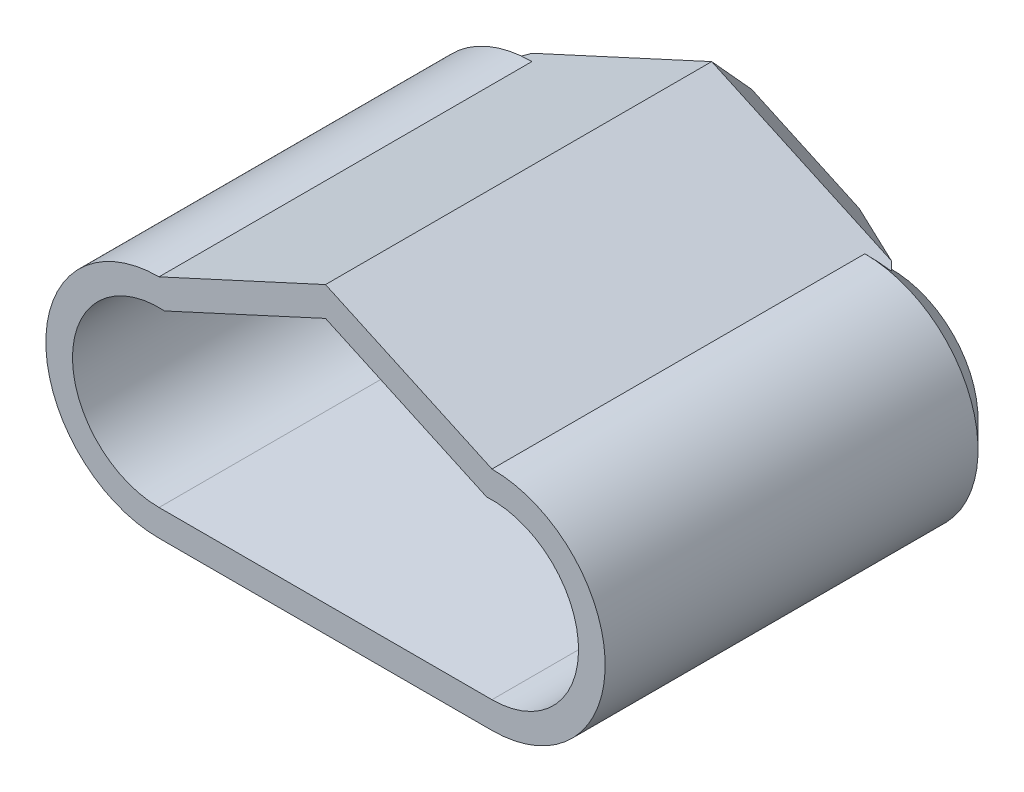
ISO-10303-21;
HEADER;
FILE_DESCRIPTION(('STEP AP214'),'2;1');
FILE_NAME('part.step','',(''),(''),'','','');
FILE_SCHEMA(('AUTOMOTIVE_DESIGN { 1 0 10303 214 1 1 1 1 }'));
ENDSEC;
DATA;
#1=APPLICATION_CONTEXT('core data for automotive mechanical design processes');
#2=APPLICATION_PROTOCOL_DEFINITION('international standard','automotive_design',2000,#1);
#3=PRODUCT_CONTEXT('',#1,'mechanical');
#4=PRODUCT('Part','Part','',(#3));
#5=PRODUCT_RELATED_PRODUCT_CATEGORY('part','',(#4));
#6=PRODUCT_DEFINITION_FORMATION('','',#4);
#7=PRODUCT_DEFINITION_CONTEXT('part definition',#1,'design');
#8=PRODUCT_DEFINITION('design','',#6,#7);
#9=PRODUCT_DEFINITION_SHAPE('','',#8);
#10=(LENGTH_UNIT() NAMED_UNIT(*) SI_UNIT(.MILLI.,.METRE.));
#11=(NAMED_UNIT(*) PLANE_ANGLE_UNIT() SI_UNIT($,.RADIAN.));
#12=(NAMED_UNIT(*) SI_UNIT($,.STERADIAN.) SOLID_ANGLE_UNIT());
#13=UNCERTAINTY_MEASURE_WITH_UNIT(LENGTH_MEASURE(1.E-05),#10,'distance_accuracy_value','');
#14=(GEOMETRIC_REPRESENTATION_CONTEXT(3) GLOBAL_UNCERTAINTY_ASSIGNED_CONTEXT((#13)) GLOBAL_UNIT_ASSIGNED_CONTEXT((#10,
#11,#12)) REPRESENTATION_CONTEXT('',''));
#15=CARTESIAN_POINT('',(0.,0.,0.));
#16=DIRECTION('',(0.,0.,1.));
#17=DIRECTION('',(1.,0.,0.));
#18=AXIS2_PLACEMENT_3D('',#15,#16,#17);
#19=CARTESIAN_POINT('',(-12.5,0.,0.));
#20=DIRECTION('',(0.,0.,1.));
#21=DIRECTION('',(1.,0.,0.));
#22=AXIS2_PLACEMENT_3D('',#19,#20,#21);
#23=PLANE('',#22);
#24=CARTESIAN_POINT('',(-12.5,0.,0.));
#25=DIRECTION('',(0.,0.,1.));
#26=DIRECTION('',(1.,0.,0.));
#27=AXIS2_PLACEMENT_3D('',#24,#25,#26);
#28=CIRCLE('',#27,3.5);
#29=CARTESIAN_POINT('',(-9.,0.,0.));
#30=VERTEX_POINT('',#29);
#31=EDGE_CURVE('E467',#30,#30,#28,.T.);
#32=ORIENTED_EDGE('',*,*,#31,.T.);
#33=EDGE_LOOP('',(#32));
#34=FACE_BOUND('',#33,.T.);
#35=DIRECTION('',(0.,1.,0.));
#36=VECTOR('',#35,1.);
#37=CARTESIAN_POINT('',(-3.,-8.5,0.));
#38=LINE('',#37,#36);
#39=CARTESIAN_POINT('',(-3.,-6.49999999999998,0.));
#40=VERTEX_POINT('',#39);
#41=CARTESIAN_POINT('',(-3.,0.,0.));
#42=VERTEX_POINT('',#41);
#43=EDGE_CURVE('E221',#40,#42,#38,.T.);
#44=ORIENTED_EDGE('',*,*,#43,.F.);
#45=DIRECTION('',(-1.,0.,0.));
#46=VECTOR('',#45,1.);
#47=CARTESIAN_POINT('',(-12.5,-6.49999999999998,0.));
#48=LINE('',#47,#46);
#49=CARTESIAN_POINT('',(-12.5,-6.49999999999998,0.));
#50=VERTEX_POINT('',#49);
#51=EDGE_CURVE('E248',#40,#50,#48,.T.);
#52=ORIENTED_EDGE('',*,*,#51,.T.);
#53=CARTESIAN_POINT('',(-12.5,0.,0.));
#54=DIRECTION('',(0.,0.,1.));
#55=DIRECTION('',(1.,0.,0.));
#56=AXIS2_PLACEMENT_3D('',#53,#54,#55);
#57=CIRCLE('',#56,6.49999999999998);
#58=CARTESIAN_POINT('',(-9.36212708239051,5.69242949477045,0.));
#59=VERTEX_POINT('',#58);
#60=EDGE_CURVE('E246',#50,#59,#57,.F.);
#61=ORIENTED_EDGE('',*,*,#60,.T.);
#62=DIRECTION('',(-0.745241313525099,0.666794859469826,0.));
#63=VECTOR('',#62,1.);
#64=CARTESIAN_POINT('',(-3.,0.,0.));
#65=LINE('',#64,#63);
#66=EDGE_CURVE('E406',#42,#59,#65,.T.);
#67=ORIENTED_EDGE('',*,*,#66,.F.);
#68=EDGE_LOOP('',(#44,#52,#61,#67));
#69=FACE_BOUND('',#68,.T.);
#70=ADVANCED_FACE('F63',(#34,#69),#23,.F.);
#71=CARTESIAN_POINT('',(12.5,0.,0.));
#72=DIRECTION('',(0.,0.,1.));
#73=DIRECTION('',(1.,0.,0.));
#74=AXIS2_PLACEMENT_3D('',#71,#72,#73);
#75=CIRCLE('',#74,3.5);
#76=CARTESIAN_POINT('',(16.,0.,0.));
#77=VERTEX_POINT('',#76);
#78=EDGE_CURVE('E463',#77,#77,#75,.T.);
#79=ORIENTED_EDGE('',*,*,#78,.T.);
#80=EDGE_LOOP('',(#79));
#81=FACE_BOUND('',#80,.T.);
#82=CARTESIAN_POINT('',(12.5,0.,0.));
#83=DIRECTION('',(0.,0.,1.));
#84=DIRECTION('',(1.,0.,0.));
#85=AXIS2_PLACEMENT_3D('',#82,#83,#84);
#86=CIRCLE('',#85,6.49999999999998);
#87=CARTESIAN_POINT('',(9.36212708239051,5.69242949477045,0.));
#88=VERTEX_POINT('',#87);
#89=CARTESIAN_POINT('',(12.5,-6.49999999999998,0.));
#90=VERTEX_POINT('',#89);
#91=EDGE_CURVE('E241',#88,#90,#86,.F.);
#92=ORIENTED_EDGE('',*,*,#91,.T.);
#93=DIRECTION('',(-1.,0.,0.));
#94=VECTOR('',#93,1.);
#95=CARTESIAN_POINT('',(-12.5,-6.49999999999998,0.));
#96=LINE('',#95,#94);
#97=CARTESIAN_POINT('',(3.,-6.49999999999998,0.));
#98=VERTEX_POINT('',#97);
#99=EDGE_CURVE('E217',#90,#98,#96,.T.);
#100=ORIENTED_EDGE('',*,*,#99,.T.);
#101=DIRECTION('',(0.,-1.,0.));
#102=VECTOR('',#101,1.);
#103=CARTESIAN_POINT('',(3.,0.,0.));
#104=LINE('',#103,#102);
#105=CARTESIAN_POINT('',(3.,0.,0.));
#106=VERTEX_POINT('',#105);
#107=EDGE_CURVE('E211',#106,#98,#104,.T.);
#108=ORIENTED_EDGE('',*,*,#107,.F.);
#109=DIRECTION('',(-0.745241313525099,-0.666794859469826,0.));
#110=VECTOR('',#109,1.);
#111=CARTESIAN_POINT('',(12.5,8.5,0.));
#112=LINE('',#111,#110);
#113=EDGE_CURVE('E201',#88,#106,#112,.T.);
#114=ORIENTED_EDGE('',*,*,#113,.F.);
#115=EDGE_LOOP('',(#92,#100,#108,#114));
#116=FACE_BOUND('',#115,.T.);
#117=ADVANCED_FACE('F215',(#81,#116),#23,.F.);
#118=CARTESIAN_POINT('',(-12.5,0.,5.));
#119=DIRECTION('',(0.,0.,1.));
#120=DIRECTION('',(1.,0.,0.));
#121=AXIS2_PLACEMENT_3D('',#118,#119,#120);
#122=PLANE('',#121);
#123=CARTESIAN_POINT('',(-12.5,0.,5.));
#124=DIRECTION('',(0.,0.,1.));
#125=DIRECTION('',(1.,0.,0.));
#126=AXIS2_PLACEMENT_3D('',#123,#124,#125);
#127=CIRCLE('',#126,6.5);
#128=CARTESIAN_POINT('',(-12.0903864255455,6.48708075482514,5.));
#129=VERTEX_POINT('',#128);
#130=CARTESIAN_POINT('',(-12.5,-6.5,5.));
#131=VERTEX_POINT('',#130);
#132=EDGE_CURVE('E409',#129,#131,#127,.T.);
#133=ORIENTED_EDGE('',*,*,#132,.T.);
#134=DIRECTION('',(1.,0.,0.));
#135=VECTOR('',#134,1.);
#136=CARTESIAN_POINT('',(-12.5,-6.5,5.));
#137=LINE('',#136,#135);
#138=CARTESIAN_POINT('',(12.5,-6.5,5.));
#139=VERTEX_POINT('',#138);
#140=EDGE_CURVE('E427',#131,#139,#137,.T.);
#141=ORIENTED_EDGE('',*,*,#140,.T.);
#142=CARTESIAN_POINT('',(12.5,0.,5.));
#143=DIRECTION('',(0.,0.,1.));
#144=DIRECTION('',(1.,0.,0.));
#145=AXIS2_PLACEMENT_3D('',#142,#143,#144);
#146=CIRCLE('',#145,6.5);
#147=CARTESIAN_POINT('',(12.0903864255455,6.48708075482513,5.));
#148=VERTEX_POINT('',#147);
#149=EDGE_CURVE('E429',#139,#148,#146,.T.);
#150=ORIENTED_EDGE('',*,*,#149,.T.);
#151=DIRECTION('',(-0.908581589602671,0.41770742755556,0.));
#152=VECTOR('',#151,1.);
#153=CARTESIAN_POINT('',(11.6645851448889,6.68283682079466,5.));
#154=LINE('',#153,#152);
#155=CARTESIAN_POINT('',(0.,12.0454634798986,5.));
#156=VERTEX_POINT('',#155);
#157=EDGE_CURVE('E431',#148,#156,#154,.T.);
#158=ORIENTED_EDGE('',*,*,#157,.T.);
#159=DIRECTION('',(-0.908581589602671,-0.41770742755556,0.));
#160=VECTOR('',#159,1.);
#161=CARTESIAN_POINT('',(0.835414855111121,12.4295335447816,5.));
#162=LINE('',#161,#160);
#163=EDGE_CURVE('E416',#156,#129,#162,.T.);
#164=ORIENTED_EDGE('',*,*,#163,.T.);
#165=EDGE_LOOP('',(#133,#141,#150,#158,#164));
#166=FACE_BOUND('',#165,.T.);
#167=CARTESIAN_POINT('',(-12.5,0.,5.));
#168=DIRECTION('',(0.,0.,1.));
#169=DIRECTION('',(1.,0.,0.));
#170=AXIS2_PLACEMENT_3D('',#167,#168,#169);
#171=CIRCLE('',#170,3.5);
#172=CARTESIAN_POINT('',(-9.,0.,5.));
#173=VERTEX_POINT('',#172);
#174=EDGE_CURVE('E470',#173,#173,#171,.T.);
#175=ORIENTED_EDGE('',*,*,#174,.F.);
#176=EDGE_LOOP('',(#175));
#177=FACE_BOUND('',#176,.T.);
#178=CARTESIAN_POINT('',(12.5,0.,5.));
#179=DIRECTION('',(0.,0.,1.));
#180=DIRECTION('',(1.,0.,0.));
#181=AXIS2_PLACEMENT_3D('',#178,#179,#180);
#182=CIRCLE('',#181,3.5);
#183=CARTESIAN_POINT('',(16.,0.,5.));
#184=VERTEX_POINT('',#183);
#185=EDGE_CURVE('E464',#184,#184,#182,.T.);
#186=ORIENTED_EDGE('',*,*,#185,.F.);
#187=EDGE_LOOP('',(#186));
#188=FACE_BOUND('',#187,.T.);
#189=ADVANCED_FACE('F311',(#166,#177,#188),#122,.T.);
#190=CARTESIAN_POINT('',(-12.5,0.,5.));
#191=DIRECTION('',(0.,0.,-1.));
#192=DIRECTION('',(-1.,0.,0.));
#193=AXIS2_PLACEMENT_3D('',#190,#191,#192);
#194=CYLINDRICAL_SURFACE('',#193,8.5);
#195=DIRECTION('',(0.,0.,-1.));
#196=VECTOR('',#195,1.);
#197=CARTESIAN_POINT('',(-12.5,8.5,5.));
#198=LINE('',#197,#196);
#199=CARTESIAN_POINT('',(-12.5,8.5,30.));
#200=VERTEX_POINT('',#199);
#201=CARTESIAN_POINT('',(-12.5,8.5,2.00000000000001));
#202=VERTEX_POINT('',#201);
#203=EDGE_CURVE('E473',#200,#202,#198,.T.);
#204=ORIENTED_EDGE('',*,*,#203,.T.);
#205=CARTESIAN_POINT('',(-12.5,0.,2.00000000000001));
#206=DIRECTION('',(0.,0.,1.));
#207=DIRECTION('',(1.,0.,0.));
#208=AXIS2_PLACEMENT_3D('',#205,#206,#207);
#209=CIRCLE('',#208,8.5);
#210=CARTESIAN_POINT('',(-12.5,-8.5,2.00000000000001));
#211=VERTEX_POINT('',#210);
#212=EDGE_CURVE('E250',#202,#211,#209,.T.);
#213=ORIENTED_EDGE('',*,*,#212,.T.);
#214=DIRECTION('',(0.,0.,-1.));
#215=VECTOR('',#214,1.);
#216=CARTESIAN_POINT('',(-12.5,-8.5,5.));
#217=LINE('',#216,#215);
#218=CARTESIAN_POINT('',(-12.5,-8.5,30.));
#219=VERTEX_POINT('',#218);
#220=EDGE_CURVE('E485',#219,#211,#217,.T.);
#221=ORIENTED_EDGE('',*,*,#220,.F.);
#222=CARTESIAN_POINT('',(-12.5,0.,30.));
#223=DIRECTION('',(0.,0.,1.));
#224=DIRECTION('',(1.,0.,0.));
#225=AXIS2_PLACEMENT_3D('',#222,#223,#224);
#226=CIRCLE('',#225,8.5);
#227=EDGE_CURVE('E448',#200,#219,#226,.T.);
#228=ORIENTED_EDGE('',*,*,#227,.F.);
#229=EDGE_LOOP('',(#204,#213,#221,#228));
#230=FACE_BOUND('',#229,.T.);
#231=ADVANCED_FACE('F314',(#230),#194,.T.);
#232=CARTESIAN_POINT('',(-12.5,-8.5,5.));
#233=DIRECTION('',(0.,1.,0.));
#234=DIRECTION('',(0.,0.,1.));
#235=AXIS2_PLACEMENT_3D('',#232,#233,#234);
#236=PLANE('',#235);
#237=DIRECTION('',(-0.707106781186546,0.,-0.707106781186549));
#238=VECTOR('',#237,1.);
#239=CARTESIAN_POINT('',(0.999999999999991,-8.5,-2.));
#240=LINE('',#239,#238);
#241=CARTESIAN_POINT('',(0.999999999999991,-8.5,-2.));
#242=VERTEX_POINT('',#241);
#243=CARTESIAN_POINT('',(4.99999999999999,-8.5,2.00000000000002));
#244=VERTEX_POINT('',#243);
#245=EDGE_CURVE('E387',#242,#244,#240,.F.);
#246=ORIENTED_EDGE('',*,*,#245,.T.);
#247=DIRECTION('',(1.,0.,0.));
#248=VECTOR('',#247,1.);
#249=CARTESIAN_POINT('',(-12.5,-8.5,2.00000000000001));
#250=LINE('',#249,#248);
#251=CARTESIAN_POINT('',(12.5,-8.5,2.00000000000001));
#252=VERTEX_POINT('',#251);
#253=EDGE_CURVE('E237',#244,#252,#250,.T.);
#254=ORIENTED_EDGE('',*,*,#253,.T.);
#255=DIRECTION('',(0.,0.,-1.));
#256=VECTOR('',#255,1.);
#257=CARTESIAN_POINT('',(12.5,-8.5,5.));
#258=LINE('',#257,#256);
#259=CARTESIAN_POINT('',(12.5,-8.5,30.));
#260=VERTEX_POINT('',#259);
#261=EDGE_CURVE('E482',#260,#252,#258,.T.);
#262=ORIENTED_EDGE('',*,*,#261,.F.);
#263=DIRECTION('',(1.,0.,0.));
#264=VECTOR('',#263,1.);
#265=CARTESIAN_POINT('',(-12.5,-8.5,30.));
#266=LINE('',#265,#264);
#267=EDGE_CURVE('E451',#219,#260,#266,.T.);
#268=ORIENTED_EDGE('',*,*,#267,.F.);
#269=ORIENTED_EDGE('',*,*,#220,.T.);
#270=DIRECTION('',(1.,0.,0.));
#271=VECTOR('',#270,1.);
#272=CARTESIAN_POINT('',(-12.5,-8.5,2.00000000000001));
#273=LINE('',#272,#271);
#274=CARTESIAN_POINT('',(-4.99999999999999,-8.5,2.00000000000001));
#275=VERTEX_POINT('',#274);
#276=EDGE_CURVE('E234',#211,#275,#273,.T.);
#277=ORIENTED_EDGE('',*,*,#276,.T.);
#278=DIRECTION('',(-0.707106781186546,0.,0.707106781186549));
#279=VECTOR('',#278,1.);
#280=CARTESIAN_POINT('',(-0.999999999999991,-8.5,-2.));
#281=LINE('',#280,#279);
#282=CARTESIAN_POINT('',(-0.999999999999991,-8.5,-2.));
#283=VERTEX_POINT('',#282);
#284=EDGE_CURVE('E389',#275,#283,#281,.F.);
#285=ORIENTED_EDGE('',*,*,#284,.T.);
#286=DIRECTION('',(-1.,0.,0.));
#287=VECTOR('',#286,1.);
#288=CARTESIAN_POINT('',(3.,-8.5,-2.));
#289=LINE('',#288,#287);
#290=EDGE_CURVE('E407',#242,#283,#289,.T.);
#291=ORIENTED_EDGE('',*,*,#290,.F.);
#292=EDGE_LOOP('',(#246,#254,#262,#268,#269,#277,#285,#291));
#293=FACE_BOUND('',#292,.T.);
#294=ADVANCED_FACE('F492',(#293),#236,.F.);
#295=CARTESIAN_POINT('',(12.5,0.,5.));
#296=DIRECTION('',(0.,0.,-1.));
#297=DIRECTION('',(-1.,0.,0.));
#298=AXIS2_PLACEMENT_3D('',#295,#296,#297);
#299=CYLINDRICAL_SURFACE('',#298,8.5);
#300=ORIENTED_EDGE('',*,*,#261,.T.);
#301=CARTESIAN_POINT('',(12.5,0.,2.00000000000001));
#302=DIRECTION('',(0.,0.,1.));
#303=DIRECTION('',(1.,0.,0.));
#304=AXIS2_PLACEMENT_3D('',#301,#302,#303);
#305=CIRCLE('',#304,8.5);
#306=CARTESIAN_POINT('',(12.5,8.5,2.00000000000001));
#307=VERTEX_POINT('',#306);
#308=EDGE_CURVE('E244',#252,#307,#305,.T.);
#309=ORIENTED_EDGE('',*,*,#308,.T.);
#310=DIRECTION('',(0.,0.,-1.));
#311=VECTOR('',#310,1.);
#312=CARTESIAN_POINT('',(12.5,8.5,5.));
#313=LINE('',#312,#311);
#314=CARTESIAN_POINT('',(12.5,8.5,30.));
#315=VERTEX_POINT('',#314);
#316=EDGE_CURVE('E480',#315,#307,#313,.T.);
#317=ORIENTED_EDGE('',*,*,#316,.F.);
#318=CARTESIAN_POINT('',(12.5,0.,30.));
#319=DIRECTION('',(0.,0.,1.));
#320=DIRECTION('',(1.,0.,0.));
#321=AXIS2_PLACEMENT_3D('',#318,#319,#320);
#322=CIRCLE('',#321,8.5);
#323=EDGE_CURVE('E454',#260,#315,#322,.T.);
#324=ORIENTED_EDGE('',*,*,#323,.F.);
#325=EDGE_LOOP('',(#300,#309,#317,#324));
#326=FACE_BOUND('',#325,.T.);
#327=ADVANCED_FACE('F506',(#326),#299,.T.);
#328=CARTESIAN_POINT('',(0.,14.2466967239869,5.));
#329=DIRECTION('',(-0.41770742755556,-0.908581589602671,0.));
#330=DIRECTION('',(0.908581589602671,-0.41770742755556,0.));
#331=AXIS2_PLACEMENT_3D('',#328,#329,#330);
#332=PLANE('',#331);
#333=DIRECTION('',(0.669609996445444,-0.307843645833754,0.675910306460935));
#334=VECTOR('',#333,1.);
#335=CARTESIAN_POINT('',(7.74241117324123,10.6872336099849,-4.80235262164523));
#336=LINE('',#335,#334);
#337=CARTESIAN_POINT('',(13.9521974832325,7.83237291844204,1.46586109995968));
#338=VERTEX_POINT('',#337);
#339=CARTESIAN_POINT('',(13.4906787780046,8.0445495609534,1.00000000000001));
#340=VERTEX_POINT('',#339);
#341=EDGE_CURVE('E238',#338,#340,#336,.F.);
#342=ORIENTED_EDGE('',*,*,#341,.T.);
#343=DIRECTION('',(-0.908581589602671,0.41770742755556,0.));
#344=VECTOR('',#343,1.);
#345=CARTESIAN_POINT('',(0.,14.2466967239869,1.00000000000002));
#346=LINE('',#345,#344);
#347=CARTESIAN_POINT('',(0.,14.2466967239869,1.00000000000002));
#348=VERTEX_POINT('',#347);
#349=EDGE_CURVE('E12',#340,#348,#346,.T.);
#350=ORIENTED_EDGE('',*,*,#349,.T.);
#351=DIRECTION('',(0.,0.,-1.));
#352=VECTOR('',#351,1.);
#353=CARTESIAN_POINT('',(0.,14.2466967239869,5.));
#354=LINE('',#353,#352);
#355=CARTESIAN_POINT('',(0.,14.2466967239869,30.));
#356=VERTEX_POINT('',#355);
#357=EDGE_CURVE('E478',#356,#348,#354,.T.);
#358=ORIENTED_EDGE('',*,*,#357,.F.);
#359=DIRECTION('',(-0.908581589602671,0.41770742755556,0.));
#360=VECTOR('',#359,1.);
#361=CARTESIAN_POINT('',(12.5,8.5,30.));
#362=LINE('',#361,#360);
#363=EDGE_CURVE('E457',#315,#356,#362,.T.);
#364=ORIENTED_EDGE('',*,*,#363,.F.);
#365=ORIENTED_EDGE('',*,*,#316,.T.);
#366=CARTESIAN_POINT('',(12.5,8.5,2.00000000000001));
#367=CARTESIAN_POINT('',(12.6179262819994,8.44578507372498,1.94578814518541));
#368=CARTESIAN_POINT('',(12.7366577623017,8.39119996901399,1.89365420830995));
#369=CARTESIAN_POINT('',(12.9755424277295,8.28137615107601,1.79412645904957));
#370=CARTESIAN_POINT('',(13.0956932016034,8.22613854638755,1.74672562402031));
#371=CARTESIAN_POINT('',(13.3376029899084,8.11492397135133,1.65707461204479));
#372=CARTESIAN_POINT('',(13.4593622652077,8.05894688107314,1.61482528222833));
#373=CARTESIAN_POINT('',(13.7045735102787,7.94621450837438,1.53595826072242));
#374=CARTESIAN_POINT('',(13.8280277569112,7.88945817919958,1.49934916268672));
#375=CARTESIAN_POINT('',(13.9521974832326,7.83237291844203,1.46586109995972));
#376=B_SPLINE_CURVE_WITH_KNOTS('',3,(#366,#367,#368,#369,#370,#371,#372,#373,#374,#375),
.UNSPECIFIED.,.F.,.F.,(4,2,2,2,4),(0.,0.421981641871252,0.843327571440572,1.26474269528835,
1.68679368382566),.UNSPECIFIED.);
#377=EDGE_CURVE('E254',#307,#338,#376,.T.);
#378=ORIENTED_EDGE('',*,*,#377,.T.);
#379=EDGE_LOOP('',(#342,#350,#358,#364,#365,#378));
#380=FACE_BOUND('',#379,.T.);
#381=ADVANCED_FACE('F267',(#380),#332,.F.);
#382=CARTESIAN_POINT('',(-12.5,8.5,5.));
#383=DIRECTION('',(0.41770742755556,-0.908581589602671,0.));
#384=DIRECTION('',(0.908581589602671,0.41770742755556,0.));
#385=AXIS2_PLACEMENT_3D('',#382,#383,#384);
#386=PLANE('',#385);
#387=ORIENTED_EDGE('',*,*,#357,.T.);
#388=DIRECTION('',(-0.908581589602671,-0.41770742755556,0.));
#389=VECTOR('',#388,1.);
#390=CARTESIAN_POINT('',(-12.5,8.5,1.00000000000002));
#391=LINE('',#390,#389);
#392=CARTESIAN_POINT('',(-13.4906787780046,8.0445495609534,1.00000000000001));
#393=VERTEX_POINT('',#392);
#394=EDGE_CURVE('E376',#348,#393,#391,.T.);
#395=ORIENTED_EDGE('',*,*,#394,.T.);
#396=DIRECTION('',(0.669609996445444,0.307843645833754,-0.675910306460935));
#397=VECTOR('',#396,1.);
#398=CARTESIAN_POINT('',(-7.74241117324123,10.6872336099849,-4.80235262164523));
#399=LINE('',#398,#397);
#400=CARTESIAN_POINT('',(-13.9521974832325,7.83237291844204,1.46586109995968));
#401=VERTEX_POINT('',#400);
#402=EDGE_CURVE('E368',#393,#401,#399,.F.);
#403=ORIENTED_EDGE('',*,*,#402,.T.);
#404=CARTESIAN_POINT('',(-13.9521974832325,7.83237291844204,1.46586109995968));
#405=CARTESIAN_POINT('',(-13.8280277569112,7.88945817919958,1.49934916268671));
#406=CARTESIAN_POINT('',(-13.7045735102787,7.94621450837438,1.53595826072242));
#407=CARTESIAN_POINT('',(-13.4593622652077,8.05894688107314,1.61482528222834));
#408=CARTESIAN_POINT('',(-13.3376029899084,8.11492397135133,1.65707461204479));
#409=CARTESIAN_POINT('',(-13.0956932016034,8.22613854638755,1.74672562402031));
#410=CARTESIAN_POINT('',(-12.9755424277295,8.28137615107601,1.79412645904957));
#411=CARTESIAN_POINT('',(-12.7366577623017,8.39119996901399,1.89365420830995));
#412=CARTESIAN_POINT('',(-12.6179262819994,8.44578507372498,1.94578814518541));
#413=CARTESIAN_POINT('',(-12.5,8.5,2.00000000000001));
#414=B_SPLINE_CURVE_WITH_KNOTS('',3,(#404,#405,#406,#407,#408,#409,#410,#411,#412,#413),
.UNSPECIFIED.,.F.,.F.,(4,2,2,2,4),(0.,0.422050988537303,0.843466112385086,1.26481204195441,
1.68679368382566),.UNSPECIFIED.);
#415=EDGE_CURVE('E296',#401,#202,#414,.T.);
#416=ORIENTED_EDGE('',*,*,#415,.T.);
#417=ORIENTED_EDGE('',*,*,#203,.F.);
#418=DIRECTION('',(-0.908581589602671,-0.41770742755556,0.));
#419=VECTOR('',#418,1.);
#420=CARTESIAN_POINT('',(0.,14.2466967239869,30.));
#421=LINE('',#420,#419);
#422=EDGE_CURVE('E460',#356,#200,#421,.T.);
#423=ORIENTED_EDGE('',*,*,#422,.F.);
#424=EDGE_LOOP('',(#387,#395,#403,#416,#417,#423));
#425=FACE_BOUND('',#424,.T.);
#426=ADVANCED_FACE('F302',(#425),#386,.F.);
#427=CARTESIAN_POINT('',(-12.5,0.,5.));
#428=DIRECTION('',(0.,0.,-1.));
#429=DIRECTION('',(-1.,0.,0.));
#430=AXIS2_PLACEMENT_3D('',#427,#428,#429);
#431=CYLINDRICAL_SURFACE('',#430,3.5);
#432=ORIENTED_EDGE('',*,*,#174,.T.);
#433=EDGE_LOOP('',(#432));
#434=FACE_BOUND('',#433,.T.);
#435=ORIENTED_EDGE('',*,*,#31,.F.);
#436=EDGE_LOOP('',(#435));
#437=FACE_BOUND('',#436,.T.);
#438=ADVANCED_FACE('F306',(#434,#437),#431,.F.);
#439=CARTESIAN_POINT('',(12.5,0.,5.));
#440=DIRECTION('',(0.,0.,-1.));
#441=DIRECTION('',(-1.,0.,0.));
#442=AXIS2_PLACEMENT_3D('',#439,#440,#441);
#443=CYLINDRICAL_SURFACE('',#442,3.5);
#444=ORIENTED_EDGE('',*,*,#185,.T.);
#445=EDGE_LOOP('',(#444));
#446=FACE_BOUND('',#445,.T.);
#447=ORIENTED_EDGE('',*,*,#78,.F.);
#448=EDGE_LOOP('',(#447));
#449=FACE_BOUND('',#448,.T.);
#450=ADVANCED_FACE('F318',(#446,#449),#443,.F.);
#451=CARTESIAN_POINT('',(-12.5,0.,30.));
#452=DIRECTION('',(0.,0.,1.));
#453=DIRECTION('',(1.,0.,0.));
#454=AXIS2_PLACEMENT_3D('',#451,#452,#453);
#455=PLANE('',#454);
#456=ORIENTED_EDGE('',*,*,#227,.T.);
#457=ORIENTED_EDGE('',*,*,#267,.T.);
#458=ORIENTED_EDGE('',*,*,#323,.T.);
#459=ORIENTED_EDGE('',*,*,#363,.T.);
#460=ORIENTED_EDGE('',*,*,#422,.T.);
#461=EDGE_LOOP('',(#456,#457,#458,#459,#460));
#462=FACE_BOUND('',#461,.T.);
#463=DIRECTION('',(1.,0.,0.));
#464=VECTOR('',#463,1.);
#465=CARTESIAN_POINT('',(-12.5,-6.5,30.));
#466=LINE('',#465,#464);
#467=CARTESIAN_POINT('',(-12.5,-6.5,30.));
#468=VERTEX_POINT('',#467);
#469=CARTESIAN_POINT('',(12.5,-6.5,30.));
#470=VERTEX_POINT('',#469);
#471=EDGE_CURVE('E415',#468,#470,#466,.T.);
#472=ORIENTED_EDGE('',*,*,#471,.F.);
#473=CARTESIAN_POINT('',(-12.5,0.,30.));
#474=DIRECTION('',(0.,0.,1.));
#475=DIRECTION('',(1.,0.,0.));
#476=AXIS2_PLACEMENT_3D('',#473,#474,#475);
#477=CIRCLE('',#476,6.5);
#478=CARTESIAN_POINT('',(-12.0903864255455,6.48708075482514,30.));
#479=VERTEX_POINT('',#478);
#480=EDGE_CURVE('E413',#479,#468,#477,.T.);
#481=ORIENTED_EDGE('',*,*,#480,.F.);
#482=DIRECTION('',(-0.908581589602671,-0.41770742755556,0.));
#483=VECTOR('',#482,1.);
#484=CARTESIAN_POINT('',(0.835414855111121,12.4295335447816,30.));
#485=LINE('',#484,#483);
#486=CARTESIAN_POINT('',(0.,12.0454634798986,30.));
#487=VERTEX_POINT('',#486);
#488=EDGE_CURVE('E423',#487,#479,#485,.T.);
#489=ORIENTED_EDGE('',*,*,#488,.F.);
#490=DIRECTION('',(-0.908581589602671,0.41770742755556,0.));
#491=VECTOR('',#490,1.);
#492=CARTESIAN_POINT('',(11.6645851448889,6.68283682079466,30.));
#493=LINE('',#492,#491);
#494=CARTESIAN_POINT('',(12.0903864255455,6.48708075482514,30.));
#495=VERTEX_POINT('',#494);
#496=EDGE_CURVE('E420',#495,#487,#493,.T.);
#497=ORIENTED_EDGE('',*,*,#496,.F.);
#498=CARTESIAN_POINT('',(12.5,0.,30.));
#499=DIRECTION('',(0.,0.,1.));
#500=DIRECTION('',(1.,0.,0.));
#501=AXIS2_PLACEMENT_3D('',#498,#499,#500);
#502=CIRCLE('',#501,6.5);
#503=EDGE_CURVE('E418',#470,#495,#502,.T.);
#504=ORIENTED_EDGE('',*,*,#503,.F.);
#505=EDGE_LOOP('',(#472,#481,#489,#497,#504));
#506=FACE_BOUND('',#505,.T.);
#507=ADVANCED_FACE('F322',(#462,#506),#455,.T.);
#508=CARTESIAN_POINT('',(-12.5,0.,30.));
#509=DIRECTION('',(0.,0.,-1.));
#510=DIRECTION('',(-1.,0.,0.));
#511=AXIS2_PLACEMENT_3D('',#508,#509,#510);
#512=CYLINDRICAL_SURFACE('',#511,6.5);
#513=ORIENTED_EDGE('',*,*,#132,.F.);
#514=DIRECTION('',(0.,0.,-1.));
#515=VECTOR('',#514,1.);
#516=CARTESIAN_POINT('',(-12.0903864255455,6.48708075482514,30.));
#517=LINE('',#516,#515);
#518=EDGE_CURVE('E425',#479,#129,#517,.T.);
#519=ORIENTED_EDGE('',*,*,#518,.F.);
#520=ORIENTED_EDGE('',*,*,#480,.T.);
#521=DIRECTION('',(0.,0.,-1.));
#522=VECTOR('',#521,1.);
#523=CARTESIAN_POINT('',(-12.5,-6.5,30.));
#524=LINE('',#523,#522);
#525=EDGE_CURVE('E445',#468,#131,#524,.T.);
#526=ORIENTED_EDGE('',*,*,#525,.T.);
#527=EDGE_LOOP('',(#513,#519,#520,#526));
#528=FACE_BOUND('',#527,.T.);
#529=ADVANCED_FACE('F326',(#528),#512,.F.);
#530=CARTESIAN_POINT('',(-12.5,-6.5,30.));
#531=DIRECTION('',(0.,1.,0.));
#532=DIRECTION('',(0.,0.,1.));
#533=AXIS2_PLACEMENT_3D('',#530,#531,#532);
#534=PLANE('',#533);
#535=ORIENTED_EDGE('',*,*,#140,.F.);
#536=ORIENTED_EDGE('',*,*,#525,.F.);
#537=ORIENTED_EDGE('',*,*,#471,.T.);
#538=DIRECTION('',(0.,0.,-1.));
#539=VECTOR('',#538,1.);
#540=CARTESIAN_POINT('',(12.5,-6.5,30.));
#541=LINE('',#540,#539);
#542=EDGE_CURVE('E442',#470,#139,#541,.T.);
#543=ORIENTED_EDGE('',*,*,#542,.T.);
#544=EDGE_LOOP('',(#535,#536,#537,#543));
#545=FACE_BOUND('',#544,.T.);
#546=ADVANCED_FACE('F330',(#545),#534,.T.);
#547=CARTESIAN_POINT('',(12.5,0.,30.));
#548=DIRECTION('',(0.,0.,-1.));
#549=DIRECTION('',(-1.,0.,0.));
#550=AXIS2_PLACEMENT_3D('',#547,#548,#549);
#551=CYLINDRICAL_SURFACE('',#550,6.5);
#552=ORIENTED_EDGE('',*,*,#149,.F.);
#553=ORIENTED_EDGE('',*,*,#542,.F.);
#554=ORIENTED_EDGE('',*,*,#503,.T.);
#555=DIRECTION('',(0.,0.,-1.));
#556=VECTOR('',#555,1.);
#557=CARTESIAN_POINT('',(12.0903864255455,6.48708075482514,30.));
#558=LINE('',#557,#556);
#559=EDGE_CURVE('E439',#495,#148,#558,.T.);
#560=ORIENTED_EDGE('',*,*,#559,.T.);
#561=EDGE_LOOP('',(#552,#553,#554,#560));
#562=FACE_BOUND('',#561,.T.);
#563=ADVANCED_FACE('F334',(#562),#551,.F.);
#564=CARTESIAN_POINT('',(11.6645851448889,6.68283682079466,30.));
#565=DIRECTION('',(-0.41770742755556,-0.908581589602671,0.));
#566=DIRECTION('',(0.908581589602671,-0.41770742755556,0.));
#567=AXIS2_PLACEMENT_3D('',#564,#565,#566);
#568=PLANE('',#567);
#569=ORIENTED_EDGE('',*,*,#157,.F.);
#570=ORIENTED_EDGE('',*,*,#559,.F.);
#571=ORIENTED_EDGE('',*,*,#496,.T.);
#572=DIRECTION('',(0.,0.,-1.));
#573=VECTOR('',#572,1.);
#574=CARTESIAN_POINT('',(0.,12.0454634798986,30.));
#575=LINE('',#574,#573);
#576=EDGE_CURVE('E436',#487,#156,#575,.T.);
#577=ORIENTED_EDGE('',*,*,#576,.T.);
#578=EDGE_LOOP('',(#569,#570,#571,#577));
#579=FACE_BOUND('',#578,.T.);
#580=ADVANCED_FACE('F338',(#579),#568,.T.);
#581=CARTESIAN_POINT('',(0.835414855111121,12.4295335447816,30.));
#582=DIRECTION('',(0.41770742755556,-0.908581589602671,0.));
#583=DIRECTION('',(0.908581589602671,0.41770742755556,0.));
#584=AXIS2_PLACEMENT_3D('',#581,#582,#583);
#585=PLANE('',#584);
#586=ORIENTED_EDGE('',*,*,#163,.F.);
#587=ORIENTED_EDGE('',*,*,#576,.F.);
#588=ORIENTED_EDGE('',*,*,#488,.T.);
#589=ORIENTED_EDGE('',*,*,#518,.T.);
#590=EDGE_LOOP('',(#586,#587,#588,#589));
#591=FACE_BOUND('',#590,.T.);
#592=ADVANCED_FACE('F342',(#591),#585,.T.);
#593=CARTESIAN_POINT('',(0.,0.,-2.));
#594=DIRECTION('',(0.,0.,1.));
#595=DIRECTION('',(1.,0.,0.));
#596=AXIS2_PLACEMENT_3D('',#593,#594,#595);
#597=PLANE('',#596);
#598=DIRECTION('',(-0.745241313525099,0.666794859469826,0.));
#599=VECTOR('',#598,1.);
#600=CARTESIAN_POINT('',(-0.000256434906497411,-0.000286603719026519,-2.));
#601=LINE('',#600,#599);
#602=CARTESIAN_POINT('',(-0.999999999999991,0.894220796627782,-2.));
#603=VERTEX_POINT('',#602);
#604=CARTESIAN_POINT('',(-8.08090400998462,7.22976648977193,-2.));
#605=VERTEX_POINT('',#604);
#606=EDGE_CURVE('E360',#603,#605,#601,.T.);
#607=ORIENTED_EDGE('',*,*,#606,.T.);
#608=DIRECTION('',(0.908581589602671,0.41770742755556,0.));
#609=VECTOR('',#608,1.);
#610=CARTESIAN_POINT('',(-4.15380227266868,9.03519550485968,-2.));
#611=LINE('',#610,#609);
#612=CARTESIAN_POINT('',(0.,10.9448468578544,-2.));
#613=VERTEX_POINT('',#612);
#614=EDGE_CURVE('E362',#605,#613,#611,.T.);
#615=ORIENTED_EDGE('',*,*,#614,.T.);
#616=DIRECTION('',(0.908581589602671,-0.41770742755556,0.));
#617=VECTOR('',#616,1.);
#618=CARTESIAN_POINT('',(4.15380227266868,9.03519550485968,-2.));
#619=LINE('',#618,#617);
#620=CARTESIAN_POINT('',(8.08090400998462,7.22976648977193,-2.));
#621=VERTEX_POINT('',#620);
#622=EDGE_CURVE('E300',#613,#621,#619,.T.);
#623=ORIENTED_EDGE('',*,*,#622,.T.);
#624=DIRECTION('',(-0.745241313525099,-0.666794859469826,0.));
#625=VECTOR('',#624,1.);
#626=CARTESIAN_POINT('',(0.000256434906495532,-0.000286603719024418,-2.));
#627=LINE('',#626,#625);
#628=CARTESIAN_POINT('',(0.999999999999992,0.894220796627788,-2.));
#629=VERTEX_POINT('',#628);
#630=EDGE_CURVE('E488',#621,#629,#627,.T.);
#631=ORIENTED_EDGE('',*,*,#630,.T.);
#632=DIRECTION('',(0.,-1.,0.));
#633=VECTOR('',#632,1.);
#634=CARTESIAN_POINT('',(0.999999999999992,0.,-2.));
#635=LINE('',#634,#633);
#636=EDGE_CURVE('E225',#629,#242,#635,.T.);
#637=ORIENTED_EDGE('',*,*,#636,.T.);
#638=ORIENTED_EDGE('',*,*,#290,.T.);
#639=DIRECTION('',(0.,1.,0.));
#640=VECTOR('',#639,1.);
#641=CARTESIAN_POINT('',(-0.999999999999991,0.,-2.));
#642=LINE('',#641,#640);
#643=EDGE_CURVE('E365',#283,#603,#642,.T.);
#644=ORIENTED_EDGE('',*,*,#643,.T.);
#645=EDGE_LOOP('',(#607,#615,#623,#631,#637,#638,#644));
#646=FACE_BOUND('',#645,.T.);
#647=ADVANCED_FACE('F346',(#646),#597,.F.);
#648=CARTESIAN_POINT('',(-0.999999999999991,0.,-2.));
#649=DIRECTION('',(0.707106781186549,0.,0.707106781186546));
#650=DIRECTION('',(0.,1.,0.));
#651=AXIS2_PLACEMENT_3D('',#648,#649,#650);
#652=PLANE('',#651);
#653=ORIENTED_EDGE('',*,*,#284,.F.);
#654=DIRECTION('',(0.577350269189624,0.577350269189628,-0.577350269189626));
#655=VECTOR('',#654,1.);
#656=CARTESIAN_POINT('',(-7.49999999999997,-11.,4.50000000000001));
#657=LINE('',#656,#655);
#658=EDGE_CURVE('E493',#275,#40,#657,.T.);
#659=ORIENTED_EDGE('',*,*,#658,.T.);
#660=ORIENTED_EDGE('',*,*,#43,.T.);
#661=DIRECTION('',(0.674214004513799,0.301448092106968,-0.674214004513801));
#662=VECTOR('',#661,1.);
#663=CARTESIAN_POINT('',(-0.727352196288921,1.01612446474445,-2.27264780371107));
#664=LINE('',#663,#662);
#665=EDGE_CURVE('E212',#603,#42,#664,.F.);
#666=ORIENTED_EDGE('',*,*,#665,.F.);
#667=ORIENTED_EDGE('',*,*,#643,.F.);
#668=EDGE_LOOP('',(#653,#659,#660,#666,#667));
#669=FACE_BOUND('',#668,.T.);
#670=ADVANCED_FACE('F349',(#669),#652,.F.);
#671=CARTESIAN_POINT('',(-0.000256434906496833,-0.000286603719025872,-2.));
#672=DIRECTION('',(0.471495166791446,0.526965186413969,0.707106781186546));
#673=DIRECTION('',(-0.745241313525099,0.666794859469826,0.));
#674=AXIS2_PLACEMENT_3D('',#671,#672,#673);
#675=PLANE('',#674);
#676=ORIENTED_EDGE('',*,*,#402,.F.);
#677=DIRECTION('',(0.867040888379541,-0.130587735750107,-0.480819031600952));
#678=VECTOR('',#677,1.);
#679=CARTESIAN_POINT('',(-1.18757509496665,6.19154069574353,-5.82270753069134));
#680=LINE('',#679,#678);
#681=EDGE_CURVE('E373',#393,#605,#680,.T.);
#682=ORIENTED_EDGE('',*,*,#681,.T.);
#683=ORIENTED_EDGE('',*,*,#606,.F.);
#684=ORIENTED_EDGE('',*,*,#665,.T.);
#685=ORIENTED_EDGE('',*,*,#66,.T.);
#686=CARTESIAN_POINT('',(-9.36212708239051,5.69242949477045,0.));
#687=CARTESIAN_POINT('',(-9.47768751257564,5.77438390669452,0.0159792872141077));
#688=CARTESIAN_POINT('',(-9.59435507551227,5.85429417197707,0.0342201873838225));
#689=CARTESIAN_POINT('',(-9.82963057888581,6.0099970951366,0.0750644326173694));
#690=CARTESIAN_POINT('',(-9.94823819176497,6.08579043896475,0.0976670480682349));
#691=CARTESIAN_POINT('',(-10.3062768687942,6.30678004874829,0.171714810332222));
#692=CARTESIAN_POINT('',(-10.5482561039599,6.44582061697173,0.229446544743051));
#693=CARTESIAN_POINT('',(-11.033164300082,6.70569241413577,0.359113637765359));
#694=CARTESIAN_POINT('',(-11.2760265932187,6.82676200481075,0.43082690560544));
#695=CARTESIAN_POINT('',(-11.764583466968,7.05382802574103,0.587375137885066));
#696=CARTESIAN_POINT('',(-12.0102784770641,7.15982213694824,0.672212116952564));
#697=CARTESIAN_POINT('',(-12.3969306017954,7.31502262408366,0.814367951233931));
#698=CARTESIAN_POINT('',(-12.537430434643,7.36902825774297,0.867805288167113));
#699=CARTESIAN_POINT('',(-12.8186670382973,7.47262989359981,0.978124190589204));
#700=CARTESIAN_POINT('',(-12.9594037470698,7.52222690869434,1.03500495986147));
#701=CARTESIAN_POINT('',(-13.2421867019754,7.61763291174295,1.15246268550808));
#702=CARTESIAN_POINT('',(-13.384233696194,7.66340522038933,1.21306747563749));
#703=CARTESIAN_POINT('',(-13.6682858090548,7.75088644624016,1.33727734065277));
#704=CARTESIAN_POINT('',(-13.8102909226426,7.79259498924814,1.40088269103502));
#705=CARTESIAN_POINT('',(-13.9521974832326,7.83237291844202,1.4658610999597));
#706=B_SPLINE_CURVE_WITH_KNOTS('',3,(#686,#687,#688,#689,#690,#691,#692,#693,#694,#695,#696,
#697,#698,#699,#700,#701,#702,#703,#704,#705),.UNSPECIFIED.,.F.,.F.,(4,2,2,2,2,2,2,2,2,4),(0.,
0.427628149092743,0.855184827906032,1.70907381299861,2.5503664832844,3.39178842925453,
3.8708819186339,4.34986504839351,4.83301218740316,5.31620377322551),.UNSPECIFIED.);
#707=EDGE_CURVE('E290',#59,#401,#706,.T.);
#708=ORIENTED_EDGE('',*,*,#707,.T.);
#709=EDGE_LOOP('',(#676,#682,#683,#684,#685,#708));
#710=FACE_BOUND('',#709,.T.);
#711=ADVANCED_FACE('F354',(#710),#675,.F.);
#712=CARTESIAN_POINT('',(0.000256434906495676,-0.000286603719024579,-2.));
#713=DIRECTION('',(-0.471495166791445,0.526965186413969,0.707106781186546));
#714=DIRECTION('',(-0.745241313525099,-0.666794859469826,0.));
#715=AXIS2_PLACEMENT_3D('',#712,#713,#714);
#716=PLANE('',#715);
#717=ORIENTED_EDGE('',*,*,#630,.F.);
#718=DIRECTION('',(0.867040888379541,0.130587735750107,0.480819031600952));
#719=VECTOR('',#718,1.);
#720=CARTESIAN_POINT('',(1.18757509496665,6.19154069574353,-5.82270753069134));
#721=LINE('',#720,#719);
#722=EDGE_CURVE('E72',#621,#340,#721,.T.);
#723=ORIENTED_EDGE('',*,*,#722,.T.);
#724=ORIENTED_EDGE('',*,*,#341,.F.);
#725=CARTESIAN_POINT('',(13.9521974832325,7.83237291844204,1.46586109995969));
#726=CARTESIAN_POINT('',(13.655712864878,7.74925161984516,1.33011210627726));
#727=CARTESIAN_POINT('',(13.3586295535024,7.65767370195228,1.2002661292381));
#728=CARTESIAN_POINT('',(12.7641567924762,7.45549187448524,0.954548998763437));
#729=CARTESIAN_POINT('',(12.4667687126454,7.34483682709346,0.838716868731121));
#730=CARTESIAN_POINT('',(11.8803688328543,7.10533550175071,0.626194725582071));
#731=CARTESIAN_POINT('',(11.5913114018403,6.97691509583625,0.529156908477498));
#732=CARTESIAN_POINT('',(11.0180306523701,6.69892561850381,0.354065494931171));
#733=CARTESIAN_POINT('',(10.7338012910351,6.54938556340219,0.275986244971175));
#734=CARTESIAN_POINT('',(10.2681629903077,6.28280237276659,0.164169826826842));
#735=CARTESIAN_POINT('',(10.084627191822,6.17197811727076,0.124379913604063));
#736=CARTESIAN_POINT('',(9.72054349615903,5.93991708404345,0.054552246139508));
#737=CARTESIAN_POINT('',(9.54002455955503,5.81861437243851,0.0245829393056203));
#738=CARTESIAN_POINT('',(9.3621270823905,5.69242949477046,0.));
#739=B_SPLINE_CURVE_WITH_KNOTS('',3,(#725,#726,#727,#728,#729,#730,#731,#732,#733,#734,#735,
#736,#737,#738),.UNSPECIFIED.,.F.,.F.,(4,2,2,2,2,2,4),(0.,1.00973417435122,2.02221834905008,
3.01365970461986,4.0037519341672,4.65748481813846,5.31568168217266),.UNSPECIFIED.);
#740=EDGE_CURVE('E208',#338,#88,#739,.T.);
#741=ORIENTED_EDGE('',*,*,#740,.T.);
#742=ORIENTED_EDGE('',*,*,#113,.T.);
#743=DIRECTION('',(-0.674214004513799,0.301448092106968,-0.674214004513801));
#744=VECTOR('',#743,1.);
#745=CARTESIAN_POINT('',(1.18174190446986,0.812962101329942,-1.81825809553014));
#746=LINE('',#745,#744);
#747=EDGE_CURVE('E205',#629,#106,#746,.F.);
#748=ORIENTED_EDGE('',*,*,#747,.F.);
#749=EDGE_LOOP('',(#717,#723,#724,#741,#742,#748));
#750=FACE_BOUND('',#749,.T.);
#751=ADVANCED_FACE('F203',(#750),#716,.F.);
#752=CARTESIAN_POINT('',(0.999999999999992,0.,-2.));
#753=DIRECTION('',(-0.707106781186549,0.,0.707106781186546));
#754=DIRECTION('',(0.,-1.,0.));
#755=AXIS2_PLACEMENT_3D('',#752,#753,#754);
#756=PLANE('',#755);
#757=ORIENTED_EDGE('',*,*,#747,.T.);
#758=ORIENTED_EDGE('',*,*,#107,.T.);
#759=DIRECTION('',(0.577350269189623,-0.577350269189628,0.577350269189626));
#760=VECTOR('',#759,1.);
#761=CARTESIAN_POINT('',(-0.833333333333292,-2.66666666666667,-3.83333333333329));
#762=LINE('',#761,#760);
#763=EDGE_CURVE('E252',#98,#244,#762,.T.);
#764=ORIENTED_EDGE('',*,*,#763,.T.);
#765=ORIENTED_EDGE('',*,*,#245,.F.);
#766=ORIENTED_EDGE('',*,*,#636,.F.);
#767=EDGE_LOOP('',(#757,#758,#764,#765,#766));
#768=FACE_BOUND('',#767,.T.);
#769=ADVANCED_FACE('F223',(#768),#756,.F.);
#770=CARTESIAN_POINT('',(12.5,0.,2.00000000000001));
#771=DIRECTION('',(0.,0.,1.));
#772=DIRECTION('',(1.,0.,0.));
#773=AXIS2_PLACEMENT_3D('',#770,#771,#772);
#774=CONICAL_SURFACE('',#773,8.5,0.78539816339745);
#775=ORIENTED_EDGE('',*,*,#377,.F.);
#776=ORIENTED_EDGE('',*,*,#308,.F.);
#777=DIRECTION('',(0.,-0.707106781186549,0.707106781186546));
#778=VECTOR('',#777,1.);
#779=CARTESIAN_POINT('',(12.5,-6.49999999999998,0.));
#780=LINE('',#779,#778);
#781=EDGE_CURVE('E226',#90,#252,#780,.T.);
#782=ORIENTED_EDGE('',*,*,#781,.F.);
#783=ORIENTED_EDGE('',*,*,#91,.F.);
#784=ORIENTED_EDGE('',*,*,#740,.F.);
#785=EDGE_LOOP('',(#775,#776,#782,#783,#784));
#786=FACE_BOUND('',#785,.T.);
#787=ADVANCED_FACE('F271',(#786),#774,.T.);
#788=CARTESIAN_POINT('',(-12.5,-8.5,2.00000000000001));
#789=DIRECTION('',(0.,0.707106781186546,0.707106781186549));
#790=DIRECTION('',(1.,0.,0.));
#791=AXIS2_PLACEMENT_3D('',#788,#789,#790);
#792=PLANE('',#791);
#793=ORIENTED_EDGE('',*,*,#763,.F.);
#794=ORIENTED_EDGE('',*,*,#99,.F.);
#795=ORIENTED_EDGE('',*,*,#781,.T.);
#796=ORIENTED_EDGE('',*,*,#253,.F.);
#797=EDGE_LOOP('',(#793,#794,#795,#796));
#798=FACE_BOUND('',#797,.T.);
#799=ADVANCED_FACE('F276',(#798),#792,.F.);
#800=CARTESIAN_POINT('',(-12.5,0.,2.00000000000001));
#801=DIRECTION('',(0.,0.,1.));
#802=DIRECTION('',(1.,0.,0.));
#803=AXIS2_PLACEMENT_3D('',#800,#801,#802);
#804=CONICAL_SURFACE('',#803,8.5,0.78539816339745);
#805=ORIENTED_EDGE('',*,*,#707,.F.);
#806=ORIENTED_EDGE('',*,*,#60,.F.);
#807=DIRECTION('',(0.,0.707106781186549,-0.707106781186546));
#808=VECTOR('',#807,1.);
#809=CARTESIAN_POINT('',(-12.5,-8.5,2.00000000000001));
#810=LINE('',#809,#808);
#811=EDGE_CURVE('E230',#211,#50,#810,.T.);
#812=ORIENTED_EDGE('',*,*,#811,.F.);
#813=ORIENTED_EDGE('',*,*,#212,.F.);
#814=ORIENTED_EDGE('',*,*,#415,.F.);
#815=EDGE_LOOP('',(#805,#806,#812,#813,#814));
#816=FACE_BOUND('',#815,.T.);
#817=ADVANCED_FACE('F282',(#816),#804,.T.);
#818=CARTESIAN_POINT('',(-12.5,-8.5,2.00000000000001));
#819=DIRECTION('',(0.,0.707106781186546,0.707106781186549));
#820=DIRECTION('',(1.,0.,0.));
#821=AXIS2_PLACEMENT_3D('',#818,#819,#820);
#822=PLANE('',#821);
#823=ORIENTED_EDGE('',*,*,#811,.T.);
#824=ORIENTED_EDGE('',*,*,#51,.F.);
#825=ORIENTED_EDGE('',*,*,#658,.F.);
#826=ORIENTED_EDGE('',*,*,#276,.F.);
#827=EDGE_LOOP('',(#823,#824,#825,#826));
#828=FACE_BOUND('',#827,.T.);
#829=ADVANCED_FACE('F278',(#828),#822,.F.);
#830=CARTESIAN_POINT('',(4.15380227266868,9.03519550485968,-2.));
#831=DIRECTION('',(-0.295363754576525,-0.642464203269301,0.707106781186547));
#832=DIRECTION('',(0.908581589602671,-0.41770742755556,0.));
#833=AXIS2_PLACEMENT_3D('',#830,#831,#832);
#834=PLANE('',#833);
#835=ORIENTED_EDGE('',*,*,#722,.F.);
#836=ORIENTED_EDGE('',*,*,#622,.F.);
#837=DIRECTION('',(0.,0.740127672481522,0.672466377172186));
#838=VECTOR('',#837,1.);
#839=CARTESIAN_POINT('',(0.,9.89876090713462,-2.95045443596604));
#840=LINE('',#839,#838);
#841=EDGE_CURVE('E67',#348,#613,#840,.F.);
#842=ORIENTED_EDGE('',*,*,#841,.F.);
#843=ORIENTED_EDGE('',*,*,#349,.F.);
#844=EDGE_LOOP('',(#835,#836,#842,#843));
#845=FACE_BOUND('',#844,.T.);
#846=ADVANCED_FACE('F65',(#845),#834,.F.);
#847=CARTESIAN_POINT('',(-4.15380227266868,9.03519550485968,-2.));
#848=DIRECTION('',(0.295363754576525,-0.642464203269301,0.707106781186547));
#849=DIRECTION('',(0.908581589602671,0.41770742755556,0.));
#850=AXIS2_PLACEMENT_3D('',#847,#848,#849);
#851=PLANE('',#850);
#852=ORIENTED_EDGE('',*,*,#681,.F.);
#853=ORIENTED_EDGE('',*,*,#394,.F.);
#854=ORIENTED_EDGE('',*,*,#841,.T.);
#855=ORIENTED_EDGE('',*,*,#614,.F.);
#856=EDGE_LOOP('',(#852,#853,#854,#855));
#857=FACE_BOUND('',#856,.T.);
#858=ADVANCED_FACE('F287',(#857),#851,.F.);
#859=CLOSED_SHELL('',(#70,#117,#189,#231,#294,#327,#381,#426,#438,#450,#507,#529,#546,#563,#580,
#592,#647,#670,#711,#751,#769,#787,#799,#817,#829,#846,#858));
#860=MANIFOLD_SOLID_BREP('B2',#859);
#861=ADVANCED_BREP_SHAPE_REPRESENTATION('',(#18,#860),#14);
#862=SHAPE_DEFINITION_REPRESENTATION(#9,#861);
ENDSEC;
END-ISO-10303-21;
